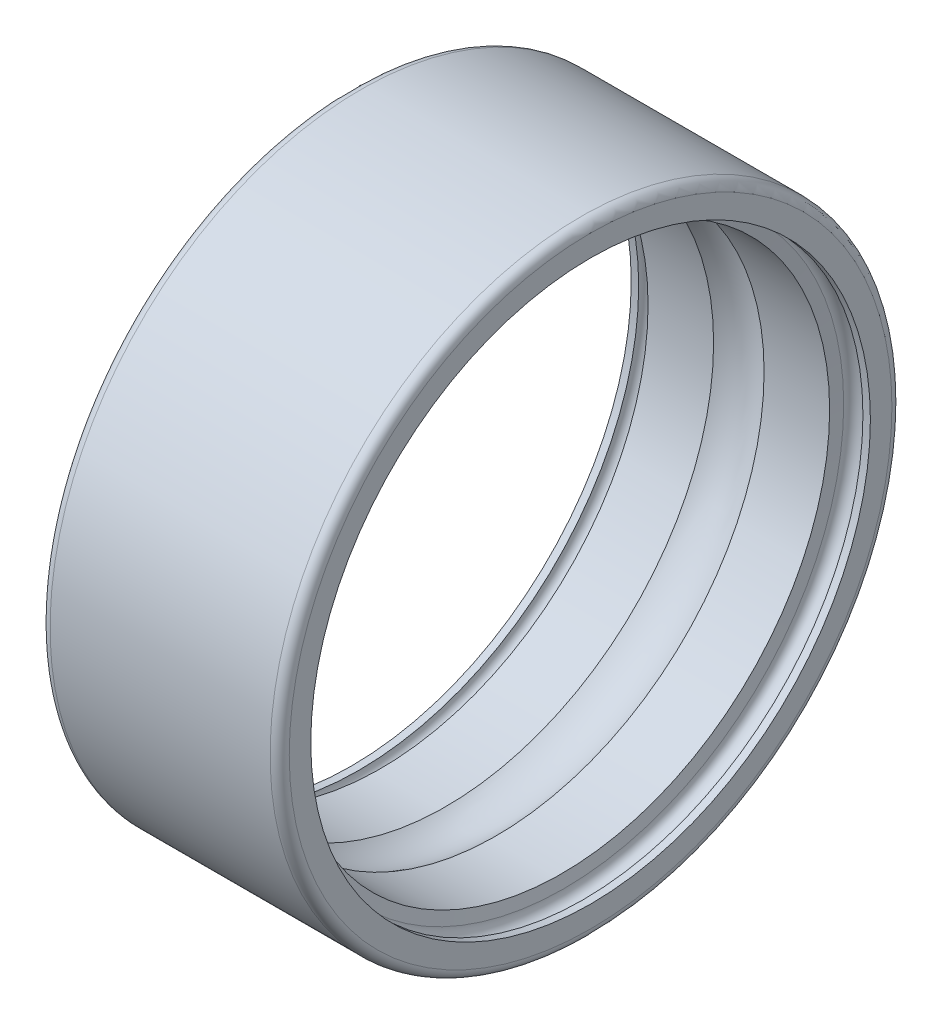
ISO-10303-21;
HEADER;
FILE_DESCRIPTION(('STEP AP214'),'2;1');
FILE_NAME('part.step','',(''),(''),'','','');
FILE_SCHEMA(('AUTOMOTIVE_DESIGN { 1 0 10303 214 1 1 1 1 }'));
ENDSEC;
DATA;
#1=APPLICATION_CONTEXT('core data for automotive mechanical design processes');
#2=APPLICATION_PROTOCOL_DEFINITION('international standard','automotive_design',2000,#1);
#3=PRODUCT_CONTEXT('',#1,'mechanical');
#4=PRODUCT('Part','Part','',(#3));
#5=PRODUCT_RELATED_PRODUCT_CATEGORY('part','',(#4));
#6=PRODUCT_DEFINITION_FORMATION('','',#4);
#7=PRODUCT_DEFINITION_CONTEXT('part definition',#1,'design');
#8=PRODUCT_DEFINITION('design','',#6,#7);
#9=PRODUCT_DEFINITION_SHAPE('','',#8);
#10=(LENGTH_UNIT() NAMED_UNIT(*) SI_UNIT(.MILLI.,.METRE.));
#11=(NAMED_UNIT(*) PLANE_ANGLE_UNIT() SI_UNIT($,.RADIAN.));
#12=(NAMED_UNIT(*) SI_UNIT($,.STERADIAN.) SOLID_ANGLE_UNIT());
#13=UNCERTAINTY_MEASURE_WITH_UNIT(LENGTH_MEASURE(1.E-05),#10,'distance_accuracy_value','');
#14=(GEOMETRIC_REPRESENTATION_CONTEXT(3) GLOBAL_UNCERTAINTY_ASSIGNED_CONTEXT((#13)) GLOBAL_UNIT_ASSIGNED_CONTEXT((#10,
#11,#12)) REPRESENTATION_CONTEXT('',''));
#15=CARTESIAN_POINT('',(0.,0.,0.));
#16=DIRECTION('',(0.,0.,1.));
#17=DIRECTION('',(1.,0.,0.));
#18=AXIS2_PLACEMENT_3D('',#15,#16,#17);
#19=CARTESIAN_POINT('',(0.,6.3,0.));
#20=DIRECTION('',(-1.,0.,0.));
#21=DIRECTION('',(0.,0.,1.));
#22=AXIS2_PLACEMENT_3D('',#19,#20,#21);
#23=PLANE('',#22);
#24=CARTESIAN_POINT('',(0.,0.,0.));
#25=DIRECTION('',(1.,0.,0.));
#26=DIRECTION('',(0.,0.,-1.));
#27=AXIS2_PLACEMENT_3D('',#24,#25,#26);
#28=CIRCLE('',#27,5.85);
#29=CARTESIAN_POINT('',(0.,0.,-5.85));
#30=VERTEX_POINT('',#29);
#31=EDGE_CURVE('E76',#30,#30,#28,.T.);
#32=ORIENTED_EDGE('',*,*,#31,.T.);
#33=EDGE_LOOP('',(#32));
#34=FACE_BOUND('',#33,.T.);
#35=CARTESIAN_POINT('',(0.,0.,0.));
#36=DIRECTION('',(1.,0.,0.));
#37=DIRECTION('',(0.,0.,-1.));
#38=AXIS2_PLACEMENT_3D('',#35,#36,#37);
#39=CIRCLE('',#38,6.3);
#40=CARTESIAN_POINT('',(0.,0.,-6.3));
#41=VERTEX_POINT('',#40);
#42=EDGE_CURVE('E10',#41,#41,#39,.T.);
#43=ORIENTED_EDGE('',*,*,#42,.F.);
#44=EDGE_LOOP('',(#43));
#45=FACE_BOUND('',#44,.T.);
#46=ADVANCED_FACE('F30',(#34,#45),#23,.T.);
#47=CARTESIAN_POINT('',(0.200000000000017,0.,0.));
#48=DIRECTION('',(1.,0.,0.));
#49=DIRECTION('',(0.,0.,-1.));
#50=AXIS2_PLACEMENT_3D('',#47,#48,#49);
#51=TOROIDAL_SURFACE('',#50,6.29999999999998,0.200000000000017);
#52=ORIENTED_EDGE('',*,*,#42,.T.);
#53=EDGE_LOOP('',(#52));
#54=FACE_BOUND('',#53,.T.);
#55=CARTESIAN_POINT('',(0.2,0.,0.));
#56=DIRECTION('',(1.,0.,0.));
#57=DIRECTION('',(0.,0.,-1.));
#58=AXIS2_PLACEMENT_3D('',#55,#56,#57);
#59=CIRCLE('',#58,6.5);
#60=CARTESIAN_POINT('',(0.2,0.,-6.5));
#61=VERTEX_POINT('',#60);
#62=EDGE_CURVE('E36',#61,#61,#59,.T.);
#63=ORIENTED_EDGE('',*,*,#62,.F.);
#64=EDGE_LOOP('',(#63));
#65=FACE_BOUND('',#64,.T.);
#66=ADVANCED_FACE('F94',(#54,#65),#51,.T.);
#67=CARTESIAN_POINT('',(4.8,0.,0.));
#68=DIRECTION('',(1.,0.,0.));
#69=DIRECTION('',(0.,0.,-1.));
#70=AXIS2_PLACEMENT_3D('',#67,#68,#69);
#71=CYLINDRICAL_SURFACE('',#70,6.5);
#72=ORIENTED_EDGE('',*,*,#62,.T.);
#73=EDGE_LOOP('',(#72));
#74=FACE_BOUND('',#73,.T.);
#75=CARTESIAN_POINT('',(4.8,0.,0.));
#76=DIRECTION('',(1.,0.,0.));
#77=DIRECTION('',(0.,0.,-1.));
#78=AXIS2_PLACEMENT_3D('',#75,#76,#77);
#79=CIRCLE('',#78,6.5);
#80=CARTESIAN_POINT('',(4.8,0.,-6.5));
#81=VERTEX_POINT('',#80);
#82=EDGE_CURVE('E40',#81,#81,#79,.T.);
#83=ORIENTED_EDGE('',*,*,#82,.F.);
#84=EDGE_LOOP('',(#83));
#85=FACE_BOUND('',#84,.T.);
#86=ADVANCED_FACE('F98',(#74,#85),#71,.T.);
#87=CARTESIAN_POINT('',(4.79999999999997,0.,0.));
#88=DIRECTION('',(1.,0.,0.));
#89=DIRECTION('',(0.,0.,-1.));
#90=AXIS2_PLACEMENT_3D('',#87,#88,#89);
#91=TOROIDAL_SURFACE('',#90,6.29999999999997,0.200000000000032);
#92=ORIENTED_EDGE('',*,*,#82,.T.);
#93=EDGE_LOOP('',(#92));
#94=FACE_BOUND('',#93,.T.);
#95=CARTESIAN_POINT('',(5.,0.,0.));
#96=DIRECTION('',(1.,0.,0.));
#97=DIRECTION('',(0.,0.,-1.));
#98=AXIS2_PLACEMENT_3D('',#95,#96,#97);
#99=CIRCLE('',#98,6.3);
#100=CARTESIAN_POINT('',(5.,0.,-6.3));
#101=VERTEX_POINT('',#100);
#102=EDGE_CURVE('E44',#101,#101,#99,.T.);
#103=ORIENTED_EDGE('',*,*,#102,.F.);
#104=EDGE_LOOP('',(#103));
#105=FACE_BOUND('',#104,.T.);
#106=ADVANCED_FACE('F102',(#94,#105),#91,.T.);
#107=CARTESIAN_POINT('',(5.,5.85,0.));
#108=DIRECTION('',(1.,0.,0.));
#109=DIRECTION('',(0.,0.,-1.));
#110=AXIS2_PLACEMENT_3D('',#107,#108,#109);
#111=PLANE('',#110);
#112=ORIENTED_EDGE('',*,*,#102,.T.);
#113=EDGE_LOOP('',(#112));
#114=FACE_BOUND('',#113,.T.);
#115=CARTESIAN_POINT('',(5.,0.,0.));
#116=DIRECTION('',(1.,0.,0.));
#117=DIRECTION('',(0.,0.,-1.));
#118=AXIS2_PLACEMENT_3D('',#115,#116,#117);
#119=CIRCLE('',#118,5.85);
#120=CARTESIAN_POINT('',(5.,0.,-5.85));
#121=VERTEX_POINT('',#120);
#122=EDGE_CURVE('E49',#121,#121,#119,.T.);
#123=ORIENTED_EDGE('',*,*,#122,.F.);
#124=EDGE_LOOP('',(#123));
#125=FACE_BOUND('',#124,.T.);
#126=ADVANCED_FACE('F108',(#114,#125),#111,.T.);
#127=CARTESIAN_POINT('',(4.8,0.,0.));
#128=DIRECTION('',(1.,0.,0.));
#129=DIRECTION('',(0.,0.,-1.));
#130=AXIS2_PLACEMENT_3D('',#127,#128,#129);
#131=CYLINDRICAL_SURFACE('',#130,5.85);
#132=ORIENTED_EDGE('',*,*,#122,.T.);
#133=EDGE_LOOP('',(#132));
#134=FACE_BOUND('',#133,.T.);
#135=CARTESIAN_POINT('',(4.844,0.,0.));
#136=DIRECTION('',(1.,0.,0.));
#137=DIRECTION('',(0.,0.,-1.));
#138=AXIS2_PLACEMENT_3D('',#135,#136,#137);
#139=CIRCLE('',#138,5.85);
#140=CARTESIAN_POINT('',(4.844,0.,-5.85));
#141=VERTEX_POINT('',#140);
#142=EDGE_CURVE('E52',#141,#141,#139,.T.);
#143=ORIENTED_EDGE('',*,*,#142,.F.);
#144=EDGE_LOOP('',(#143));
#145=FACE_BOUND('',#144,.T.);
#146=ADVANCED_FACE('F112',(#134,#145),#131,.F.);
#147=CARTESIAN_POINT('',(4.643,0.,0.));
#148=DIRECTION('',(1.,0.,0.));
#149=DIRECTION('',(0.,0.,-1.));
#150=AXIS2_PLACEMENT_3D('',#147,#148,#149);
#151=TOROIDAL_SURFACE('',#150,5.85,0.201);
#152=ORIENTED_EDGE('',*,*,#142,.T.);
#153=EDGE_LOOP('',(#152));
#154=FACE_BOUND('',#153,.T.);
#155=CARTESIAN_POINT('',(4.442,0.,0.));
#156=DIRECTION('',(1.,0.,0.));
#157=DIRECTION('',(0.,0.,-1.));
#158=AXIS2_PLACEMENT_3D('',#155,#156,#157);
#159=CIRCLE('',#158,5.85);
#160=CARTESIAN_POINT('',(4.442,0.,-5.85));
#161=VERTEX_POINT('',#160);
#162=EDGE_CURVE('E55',#161,#161,#159,.T.);
#163=ORIENTED_EDGE('',*,*,#162,.F.);
#164=EDGE_LOOP('',(#163));
#165=FACE_BOUND('',#164,.T.);
#166=ADVANCED_FACE('F116',(#154,#165),#151,.F.);
#167=CARTESIAN_POINT('',(4.3979182548229,0.,0.));
#168=DIRECTION('',(1.,0.,0.));
#169=DIRECTION('',(0.,0.,-1.));
#170=AXIS2_PLACEMENT_3D('',#167,#168,#169);
#171=CONICAL_SURFACE('',#170,5.6,1.39626340159553);
#172=ORIENTED_EDGE('',*,*,#162,.T.);
#173=EDGE_LOOP('',(#172));
#174=FACE_BOUND('',#173,.T.);
#175=CARTESIAN_POINT('',(4.3979182548229,0.,0.));
#176=DIRECTION('',(1.,0.,0.));
#177=DIRECTION('',(0.,0.,-1.));
#178=AXIS2_PLACEMENT_3D('',#175,#176,#177);
#179=CIRCLE('',#178,5.6);
#180=CARTESIAN_POINT('',(4.3979182548229,0.,-5.6));
#181=VERTEX_POINT('',#180);
#182=EDGE_CURVE('E58',#181,#181,#179,.T.);
#183=ORIENTED_EDGE('',*,*,#182,.F.);
#184=EDGE_LOOP('',(#183));
#185=FACE_BOUND('',#184,.T.);
#186=ADVANCED_FACE('F120',(#174,#185),#171,.F.);
#187=CARTESIAN_POINT('',(4.8,0.,0.));
#188=DIRECTION('',(1.,0.,0.));
#189=DIRECTION('',(0.,0.,-1.));
#190=AXIS2_PLACEMENT_3D('',#187,#188,#189);
#191=CYLINDRICAL_SURFACE('',#190,5.6);
#192=ORIENTED_EDGE('',*,*,#182,.T.);
#193=EDGE_LOOP('',(#192));
#194=FACE_BOUND('',#193,.T.);
#195=CARTESIAN_POINT('',(3.0276968826893,0.,0.));
#196=DIRECTION('',(1.,0.,0.));
#197=DIRECTION('',(0.,0.,-1.));
#198=AXIS2_PLACEMENT_3D('',#195,#196,#197);
#199=CIRCLE('',#198,5.6);
#200=CARTESIAN_POINT('',(3.0276968826893,0.,-5.6));
#201=VERTEX_POINT('',#200);
#202=EDGE_CURVE('E61',#201,#201,#199,.T.);
#203=ORIENTED_EDGE('',*,*,#202,.F.);
#204=EDGE_LOOP('',(#203));
#205=FACE_BOUND('',#204,.T.);
#206=ADVANCED_FACE('F124',(#194,#205),#191,.F.);
#207=CARTESIAN_POINT('',(2.5,0.,0.));
#208=DIRECTION('',(1.,0.,0.));
#209=DIRECTION('',(0.,0.,-1.));
#210=AXIS2_PLACEMENT_3D('',#207,#208,#209);
#211=TOROIDAL_SURFACE('',#210,4.75999999999998,0.992000000000015);
#212=ORIENTED_EDGE('',*,*,#202,.T.);
#213=EDGE_LOOP('',(#212));
#214=FACE_BOUND('',#213,.T.);
#215=CARTESIAN_POINT('',(1.9723031173107,0.,0.));
#216=DIRECTION('',(1.,0.,0.));
#217=DIRECTION('',(0.,0.,-1.));
#218=AXIS2_PLACEMENT_3D('',#215,#216,#217);
#219=CIRCLE('',#218,5.6);
#220=CARTESIAN_POINT('',(1.9723031173107,0.,-5.6));
#221=VERTEX_POINT('',#220);
#222=EDGE_CURVE('E64',#221,#221,#219,.T.);
#223=ORIENTED_EDGE('',*,*,#222,.F.);
#224=EDGE_LOOP('',(#223));
#225=FACE_BOUND('',#224,.T.);
#226=ADVANCED_FACE('F128',(#214,#225),#211,.F.);
#227=CARTESIAN_POINT('',(4.8,0.,0.));
#228=DIRECTION('',(1.,0.,0.));
#229=DIRECTION('',(0.,0.,-1.));
#230=AXIS2_PLACEMENT_3D('',#227,#228,#229);
#231=CYLINDRICAL_SURFACE('',#230,5.6);
#232=ORIENTED_EDGE('',*,*,#222,.T.);
#233=EDGE_LOOP('',(#232));
#234=FACE_BOUND('',#233,.T.);
#235=CARTESIAN_POINT('',(0.60208174517712,0.,0.));
#236=DIRECTION('',(1.,0.,0.));
#237=DIRECTION('',(0.,0.,-1.));
#238=AXIS2_PLACEMENT_3D('',#235,#236,#237);
#239=CIRCLE('',#238,5.6);
#240=CARTESIAN_POINT('',(0.60208174517712,0.,-5.6));
#241=VERTEX_POINT('',#240);
#242=EDGE_CURVE('E67',#241,#241,#239,.T.);
#243=ORIENTED_EDGE('',*,*,#242,.F.);
#244=EDGE_LOOP('',(#243));
#245=FACE_BOUND('',#244,.T.);
#246=ADVANCED_FACE('F132',(#234,#245),#231,.F.);
#247=CARTESIAN_POINT('',(0.558,0.,0.));
#248=DIRECTION('',(-1.,0.,0.));
#249=DIRECTION('',(0.,0.,1.));
#250=AXIS2_PLACEMENT_3D('',#247,#248,#249);
#251=CONICAL_SURFACE('',#250,5.85,1.39626340159545);
#252=ORIENTED_EDGE('',*,*,#242,.T.);
#253=EDGE_LOOP('',(#252));
#254=FACE_BOUND('',#253,.T.);
#255=CARTESIAN_POINT('',(0.558,0.,0.));
#256=DIRECTION('',(1.,0.,0.));
#257=DIRECTION('',(0.,0.,-1.));
#258=AXIS2_PLACEMENT_3D('',#255,#256,#257);
#259=CIRCLE('',#258,5.85);
#260=CARTESIAN_POINT('',(0.558,0.,-5.85));
#261=VERTEX_POINT('',#260);
#262=EDGE_CURVE('E70',#261,#261,#259,.T.);
#263=ORIENTED_EDGE('',*,*,#262,.F.);
#264=EDGE_LOOP('',(#263));
#265=FACE_BOUND('',#264,.T.);
#266=ADVANCED_FACE('F90',(#254,#265),#251,.F.);
#267=CARTESIAN_POINT('',(0.357,0.,0.));
#268=DIRECTION('',(1.,0.,0.));
#269=DIRECTION('',(0.,0.,-1.));
#270=AXIS2_PLACEMENT_3D('',#267,#268,#269);
#271=TOROIDAL_SURFACE('',#270,5.85,0.201);
#272=ORIENTED_EDGE('',*,*,#262,.T.);
#273=EDGE_LOOP('',(#272));
#274=FACE_BOUND('',#273,.T.);
#275=CARTESIAN_POINT('',(0.156,0.,0.));
#276=DIRECTION('',(1.,0.,0.));
#277=DIRECTION('',(0.,0.,-1.));
#278=AXIS2_PLACEMENT_3D('',#275,#276,#277);
#279=CIRCLE('',#278,5.85);
#280=CARTESIAN_POINT('',(0.156,0.,-5.85));
#281=VERTEX_POINT('',#280);
#282=EDGE_CURVE('E73',#281,#281,#279,.T.);
#283=ORIENTED_EDGE('',*,*,#282,.F.);
#284=EDGE_LOOP('',(#283));
#285=FACE_BOUND('',#284,.T.);
#286=ADVANCED_FACE('F84',(#274,#285),#271,.F.);
#287=CARTESIAN_POINT('',(4.8,0.,0.));
#288=DIRECTION('',(1.,0.,0.));
#289=DIRECTION('',(0.,0.,-1.));
#290=AXIS2_PLACEMENT_3D('',#287,#288,#289);
#291=CYLINDRICAL_SURFACE('',#290,5.85);
#292=ORIENTED_EDGE('',*,*,#282,.T.);
#293=EDGE_LOOP('',(#292));
#294=FACE_BOUND('',#293,.T.);
#295=ORIENTED_EDGE('',*,*,#31,.F.);
#296=EDGE_LOOP('',(#295));
#297=FACE_BOUND('',#296,.T.);
#298=ADVANCED_FACE('F82',(#294,#297),#291,.F.);
#299=CLOSED_SHELL('',(#46,#66,#86,#106,#126,#146,#166,#186,#206,#226,#246,#266,#286,#298));
#300=MANIFOLD_SOLID_BREP('B2',#299);
#301=ADVANCED_BREP_SHAPE_REPRESENTATION('',(#18,#300),#14);
#302=SHAPE_DEFINITION_REPRESENTATION(#9,#301);
ENDSEC;
END-ISO-10303-21;
